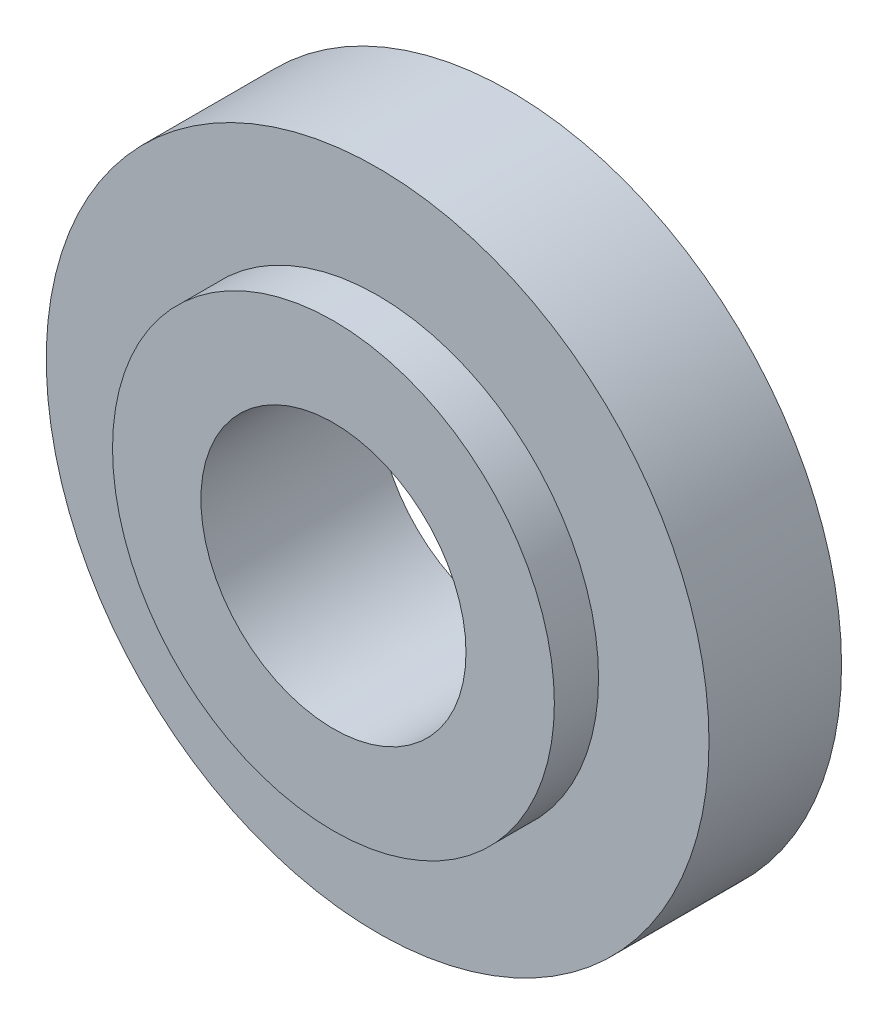
ISO-10303-21;
HEADER;
FILE_DESCRIPTION(('STEP AP214'),'2;1');
FILE_NAME('part.step','',(''),(''),'','','');
FILE_SCHEMA(('AUTOMOTIVE_DESIGN { 1 0 10303 214 1 1 1 1 }'));
ENDSEC;
DATA;
#1=APPLICATION_CONTEXT('core data for automotive mechanical design processes');
#2=APPLICATION_PROTOCOL_DEFINITION('international standard','automotive_design',2000,#1);
#3=PRODUCT_CONTEXT('',#1,'mechanical');
#4=PRODUCT('Part','Part','',(#3));
#5=PRODUCT_RELATED_PRODUCT_CATEGORY('part','',(#4));
#6=PRODUCT_DEFINITION_FORMATION('','',#4);
#7=PRODUCT_DEFINITION_CONTEXT('part definition',#1,'design');
#8=PRODUCT_DEFINITION('design','',#6,#7);
#9=PRODUCT_DEFINITION_SHAPE('','',#8);
#10=(LENGTH_UNIT() NAMED_UNIT(*) SI_UNIT(.MILLI.,.METRE.));
#11=(NAMED_UNIT(*) PLANE_ANGLE_UNIT() SI_UNIT($,.RADIAN.));
#12=(NAMED_UNIT(*) SI_UNIT($,.STERADIAN.) SOLID_ANGLE_UNIT());
#13=UNCERTAINTY_MEASURE_WITH_UNIT(LENGTH_MEASURE(1.E-05),#10,'distance_accuracy_value','');
#14=(GEOMETRIC_REPRESENTATION_CONTEXT(3) GLOBAL_UNCERTAINTY_ASSIGNED_CONTEXT((#13)) GLOBAL_UNIT_ASSIGNED_CONTEXT((#10,
#11,#12)) REPRESENTATION_CONTEXT('',''));
#15=CARTESIAN_POINT('',(0.,0.,0.));
#16=DIRECTION('',(0.,0.,1.));
#17=DIRECTION('',(1.,0.,0.));
#18=AXIS2_PLACEMENT_3D('',#15,#16,#17);
#19=CARTESIAN_POINT('',(0.,0.,1.5));
#20=DIRECTION('',(0.,0.,-1.));
#21=DIRECTION('',(-1.,0.,0.));
#22=AXIS2_PLACEMENT_3D('',#19,#20,#21);
#23=CYLINDRICAL_SURFACE('',#22,3.75);
#24=CARTESIAN_POINT('',(0.,0.,1.5));
#25=DIRECTION('',(0.,0.,1.));
#26=DIRECTION('',(1.,0.,0.));
#27=AXIS2_PLACEMENT_3D('',#24,#25,#26);
#28=CIRCLE('',#27,3.75);
#29=CARTESIAN_POINT('',(3.75,0.,1.5));
#30=VERTEX_POINT('',#29);
#31=EDGE_CURVE('E10',#30,#30,#28,.T.);
#32=ORIENTED_EDGE('',*,*,#31,.F.);
#33=EDGE_LOOP('',(#32));
#34=FACE_BOUND('',#33,.T.);
#35=CARTESIAN_POINT('',(0.,0.,0.));
#36=DIRECTION('',(0.,0.,1.));
#37=DIRECTION('',(1.,0.,0.));
#38=AXIS2_PLACEMENT_3D('',#35,#36,#37);
#39=CIRCLE('',#38,3.75);
#40=CARTESIAN_POINT('',(3.75,0.,0.));
#41=VERTEX_POINT('',#40);
#42=EDGE_CURVE('E42',#41,#41,#39,.T.);
#43=ORIENTED_EDGE('',*,*,#42,.T.);
#44=EDGE_LOOP('',(#43));
#45=FACE_BOUND('',#44,.T.);
#46=ADVANCED_FACE('F39',(#34,#45),#23,.T.);
#47=CARTESIAN_POINT('',(0.,0.,1.5));
#48=DIRECTION('',(0.,0.,1.));
#49=DIRECTION('',(1.,0.,0.));
#50=AXIS2_PLACEMENT_3D('',#47,#48,#49);
#51=PLANE('',#50);
#52=CARTESIAN_POINT('',(0.,0.,1.5));
#53=DIRECTION('',(0.,0.,1.));
#54=DIRECTION('',(1.,0.,0.));
#55=AXIS2_PLACEMENT_3D('',#52,#53,#54);
#56=CIRCLE('',#55,2.5);
#57=CARTESIAN_POINT('',(2.5,0.,1.5));
#58=VERTEX_POINT('',#57);
#59=EDGE_CURVE('E47',#58,#58,#56,.T.);
#60=ORIENTED_EDGE('',*,*,#59,.F.);
#61=EDGE_LOOP('',(#60));
#62=FACE_BOUND('',#61,.T.);
#63=ORIENTED_EDGE('',*,*,#31,.T.);
#64=EDGE_LOOP('',(#63));
#65=FACE_BOUND('',#64,.T.);
#66=ADVANCED_FACE('F86',(#62,#65),#51,.T.);
#67=CARTESIAN_POINT('',(0.,0.,0.));
#68=DIRECTION('',(0.,0.,1.));
#69=DIRECTION('',(1.,0.,0.));
#70=AXIS2_PLACEMENT_3D('',#67,#68,#69);
#71=PLANE('',#70);
#72=ORIENTED_EDGE('',*,*,#42,.F.);
#73=EDGE_LOOP('',(#72));
#74=FACE_BOUND('',#73,.T.);
#75=CARTESIAN_POINT('',(0.,0.,0.));
#76=DIRECTION('',(0.,0.,1.));
#77=DIRECTION('',(1.,0.,0.));
#78=AXIS2_PLACEMENT_3D('',#75,#76,#77);
#79=CIRCLE('',#78,1.5);
#80=CARTESIAN_POINT('',(1.5,0.,0.));
#81=VERTEX_POINT('',#80);
#82=EDGE_CURVE('E54',#81,#81,#79,.T.);
#83=ORIENTED_EDGE('',*,*,#82,.T.);
#84=EDGE_LOOP('',(#83));
#85=FACE_BOUND('',#84,.T.);
#86=ADVANCED_FACE('F83',(#74,#85),#71,.F.);
#87=CARTESIAN_POINT('',(0.,0.,2.));
#88=DIRECTION('',(0.,0.,-1.));
#89=DIRECTION('',(-1.,0.,0.));
#90=AXIS2_PLACEMENT_3D('',#87,#88,#89);
#91=CYLINDRICAL_SURFACE('',#90,1.5);
#92=CARTESIAN_POINT('',(0.,0.,2.));
#93=DIRECTION('',(0.,0.,1.));
#94=DIRECTION('',(1.,0.,0.));
#95=AXIS2_PLACEMENT_3D('',#92,#93,#94);
#96=CIRCLE('',#95,1.5);
#97=CARTESIAN_POINT('',(1.5,0.,2.));
#98=VERTEX_POINT('',#97);
#99=EDGE_CURVE('E58',#98,#98,#96,.T.);
#100=ORIENTED_EDGE('',*,*,#99,.T.);
#101=EDGE_LOOP('',(#100));
#102=FACE_BOUND('',#101,.T.);
#103=ORIENTED_EDGE('',*,*,#82,.F.);
#104=EDGE_LOOP('',(#103));
#105=FACE_BOUND('',#104,.T.);
#106=ADVANCED_FACE('F67',(#102,#105),#91,.F.);
#107=CARTESIAN_POINT('',(0.,0.,2.));
#108=DIRECTION('',(0.,0.,-1.));
#109=DIRECTION('',(-1.,0.,0.));
#110=AXIS2_PLACEMENT_3D('',#107,#108,#109);
#111=CYLINDRICAL_SURFACE('',#110,2.5);
#112=ORIENTED_EDGE('',*,*,#59,.T.);
#113=EDGE_LOOP('',(#112));
#114=FACE_BOUND('',#113,.T.);
#115=CARTESIAN_POINT('',(0.,0.,2.));
#116=DIRECTION('',(0.,0.,1.));
#117=DIRECTION('',(1.,0.,0.));
#118=AXIS2_PLACEMENT_3D('',#115,#116,#117);
#119=CIRCLE('',#118,2.5);
#120=CARTESIAN_POINT('',(2.5,0.,2.));
#121=VERTEX_POINT('',#120);
#122=EDGE_CURVE('E59',#121,#121,#119,.T.);
#123=ORIENTED_EDGE('',*,*,#122,.F.);
#124=EDGE_LOOP('',(#123));
#125=FACE_BOUND('',#124,.T.);
#126=ADVANCED_FACE('F73',(#114,#125),#111,.T.);
#127=CARTESIAN_POINT('',(0.,0.,2.));
#128=DIRECTION('',(0.,0.,1.));
#129=DIRECTION('',(1.,0.,0.));
#130=AXIS2_PLACEMENT_3D('',#127,#128,#129);
#131=PLANE('',#130);
#132=ORIENTED_EDGE('',*,*,#99,.F.);
#133=EDGE_LOOP('',(#132));
#134=FACE_BOUND('',#133,.T.);
#135=ORIENTED_EDGE('',*,*,#122,.T.);
#136=EDGE_LOOP('',(#135));
#137=FACE_BOUND('',#136,.T.);
#138=ADVANCED_FACE('F70',(#134,#137),#131,.T.);
#139=CLOSED_SHELL('',(#46,#66,#86,#106,#126,#138));
#140=MANIFOLD_SOLID_BREP('B2',#139);
#141=ADVANCED_BREP_SHAPE_REPRESENTATION('',(#18,#140),#14);
#142=SHAPE_DEFINITION_REPRESENTATION(#9,#141);
ENDSEC;
END-ISO-10303-21;
